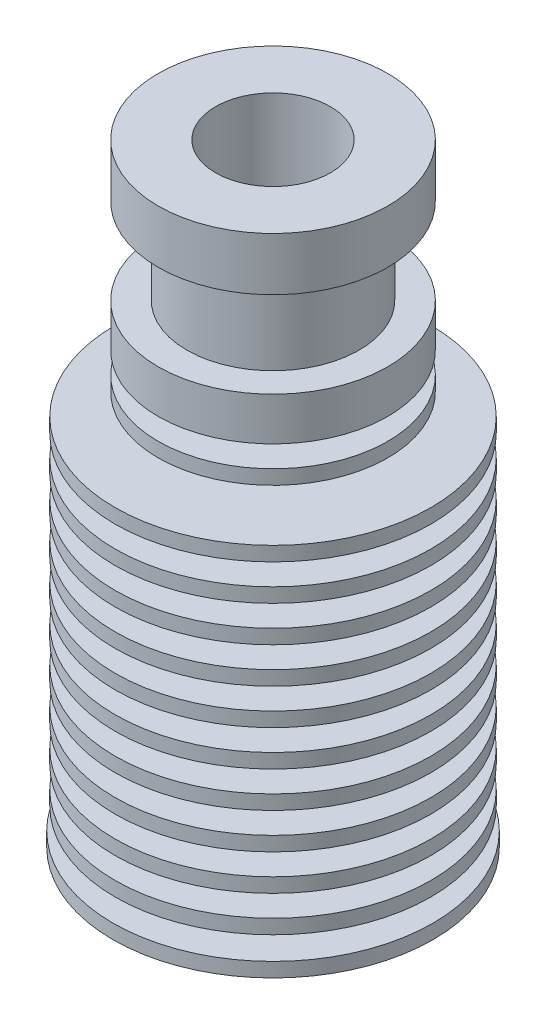
ISO-10303-21;
HEADER;
FILE_DESCRIPTION(('STEP AP214'),'2;1');
FILE_NAME('part.step','',(''),(''),'','','');
FILE_SCHEMA(('AUTOMOTIVE_DESIGN { 1 0 10303 214 1 1 1 1 }'));
ENDSEC;
DATA;
#1=APPLICATION_CONTEXT('core data for automotive mechanical design processes');
#2=APPLICATION_PROTOCOL_DEFINITION('international standard','automotive_design',2000,#1);
#3=PRODUCT_CONTEXT('',#1,'mechanical');
#4=PRODUCT('Part','Part','',(#3));
#5=PRODUCT_RELATED_PRODUCT_CATEGORY('part','',(#4));
#6=PRODUCT_DEFINITION_FORMATION('','',#4);
#7=PRODUCT_DEFINITION_CONTEXT('part definition',#1,'design');
#8=PRODUCT_DEFINITION('design','',#6,#7);
#9=PRODUCT_DEFINITION_SHAPE('','',#8);
#10=(LENGTH_UNIT() NAMED_UNIT(*) SI_UNIT(.MILLI.,.METRE.));
#11=(NAMED_UNIT(*) PLANE_ANGLE_UNIT() SI_UNIT($,.RADIAN.));
#12=(NAMED_UNIT(*) SI_UNIT($,.STERADIAN.) SOLID_ANGLE_UNIT());
#13=UNCERTAINTY_MEASURE_WITH_UNIT(LENGTH_MEASURE(1.E-05),#10,'distance_accuracy_value','');
#14=(GEOMETRIC_REPRESENTATION_CONTEXT(3) GLOBAL_UNCERTAINTY_ASSIGNED_CONTEXT((#13)) GLOBAL_UNIT_ASSIGNED_CONTEXT((#10,
#11,#12)) REPRESENTATION_CONTEXT('',''));
#15=CARTESIAN_POINT('',(0.,0.,0.));
#16=DIRECTION('',(0.,0.,1.));
#17=DIRECTION('',(1.,0.,0.));
#18=AXIS2_PLACEMENT_3D('',#15,#16,#17);
#19=CARTESIAN_POINT('',(0.,0.,0.));
#20=DIRECTION('',(0.,1.,0.));
#21=DIRECTION('',(0.,0.,1.));
#22=AXIS2_PLACEMENT_3D('',#19,#20,#21);
#23=PLANE('',#22);
#24=CARTESIAN_POINT('',(0.,0.,0.));
#25=DIRECTION('',(0.,-1.,0.));
#26=DIRECTION('',(0.,0.,-1.));
#27=AXIS2_PLACEMENT_3D('',#24,#25,#26);
#28=CIRCLE('',#27,3.);
#29=CARTESIAN_POINT('',(0.,0.,-3.));
#30=VERTEX_POINT('',#29);
#31=EDGE_CURVE('E285',#30,#30,#28,.T.);
#32=ORIENTED_EDGE('',*,*,#31,.F.);
#33=EDGE_LOOP('',(#32));
#34=FACE_BOUND('',#33,.T.);
#35=CARTESIAN_POINT('',(0.,0.,0.));
#36=DIRECTION('',(0.,1.,0.));
#37=DIRECTION('',(0.,0.,1.));
#38=AXIS2_PLACEMENT_3D('',#35,#36,#37);
#39=CIRCLE('',#38,11.15);
#40=CARTESIAN_POINT('',(0.,0.,11.15));
#41=VERTEX_POINT('',#40);
#42=EDGE_CURVE('E111',#41,#41,#39,.T.);
#43=ORIENTED_EDGE('',*,*,#42,.F.);
#44=EDGE_LOOP('',(#43));
#45=FACE_BOUND('',#44,.T.);
#46=ADVANCED_FACE('F45',(#34,#45),#23,.F.);
#47=CARTESIAN_POINT('',(0.,42.7,0.));
#48=DIRECTION('',(0.,-1.,0.));
#49=DIRECTION('',(0.,0.,-1.));
#50=AXIS2_PLACEMENT_3D('',#47,#48,#49);
#51=PLANE('',#50);
#52=CARTESIAN_POINT('',(0.,42.7,0.));
#53=DIRECTION('',(0.,1.,0.));
#54=DIRECTION('',(0.,0.,1.));
#55=AXIS2_PLACEMENT_3D('',#52,#53,#54);
#56=CIRCLE('',#55,7.99999999999999);
#57=CARTESIAN_POINT('',(0.,42.7,7.99999999999999));
#58=VERTEX_POINT('',#57);
#59=EDGE_CURVE('E107',#58,#58,#56,.T.);
#60=ORIENTED_EDGE('',*,*,#59,.T.);
#61=EDGE_LOOP('',(#60));
#62=FACE_BOUND('',#61,.T.);
#63=CARTESIAN_POINT('',(0.,42.7,0.));
#64=DIRECTION('',(0.,1.,0.));
#65=DIRECTION('',(0.,0.,1.));
#66=AXIS2_PLACEMENT_3D('',#63,#64,#65);
#67=CIRCLE('',#66,4.);
#68=CARTESIAN_POINT('',(0.,42.7,4.));
#69=VERTEX_POINT('',#68);
#70=EDGE_CURVE('E277',#69,#69,#67,.T.);
#71=ORIENTED_EDGE('',*,*,#70,.F.);
#72=EDGE_LOOP('',(#71));
#73=FACE_BOUND('',#72,.T.);
#74=ADVANCED_FACE('F294',(#62,#73),#51,.F.);
#75=CARTESIAN_POINT('',(0.,0.,0.));
#76=DIRECTION('',(0.,1.,0.));
#77=DIRECTION('',(0.,0.,1.));
#78=AXIS2_PLACEMENT_3D('',#75,#76,#77);
#79=CYLINDRICAL_SURFACE('',#78,11.);
#80=CARTESIAN_POINT('',(0.,22.5,0.));
#81=DIRECTION('',(0.,-1.,0.));
#82=DIRECTION('',(0.,0.,-1.));
#83=AXIS2_PLACEMENT_3D('',#80,#81,#82);
#84=CIRCLE('',#83,11.);
#85=CARTESIAN_POINT('',(0.,22.5,-11.));
#86=VERTEX_POINT('',#85);
#87=EDGE_CURVE('E237',#86,#86,#84,.T.);
#88=ORIENTED_EDGE('',*,*,#87,.F.);
#89=EDGE_LOOP('',(#88));
#90=FACE_BOUND('',#89,.T.);
#91=CARTESIAN_POINT('',(0.,23.5,0.));
#92=DIRECTION('',(0.,-1.,0.));
#93=DIRECTION('',(0.,0.,-1.));
#94=AXIS2_PLACEMENT_3D('',#91,#92,#93);
#95=CIRCLE('',#94,11.);
#96=CARTESIAN_POINT('',(0.,23.5,-11.));
#97=VERTEX_POINT('',#96);
#98=EDGE_CURVE('E265',#97,#97,#95,.T.);
#99=ORIENTED_EDGE('',*,*,#98,.T.);
#100=EDGE_LOOP('',(#99));
#101=FACE_BOUND('',#100,.T.);
#102=ADVANCED_FACE('F361',(#90,#101),#79,.T.);
#103=CARTESIAN_POINT('',(0.,20.,0.));
#104=DIRECTION('',(0.,-1.,0.));
#105=DIRECTION('',(0.,0.,-1.));
#106=AXIS2_PLACEMENT_3D('',#103,#104,#105);
#107=CIRCLE('',#106,11.);
#108=CARTESIAN_POINT('',(0.,20.,-11.));
#109=VERTEX_POINT('',#108);
#110=EDGE_CURVE('E221',#109,#109,#107,.T.);
#111=ORIENTED_EDGE('',*,*,#110,.F.);
#112=EDGE_LOOP('',(#111));
#113=FACE_BOUND('',#112,.T.);
#114=CARTESIAN_POINT('',(0.,21.,0.));
#115=DIRECTION('',(0.,-1.,0.));
#116=DIRECTION('',(0.,0.,-1.));
#117=AXIS2_PLACEMENT_3D('',#114,#115,#116);
#118=CIRCLE('',#117,11.);
#119=CARTESIAN_POINT('',(0.,21.,-11.));
#120=VERTEX_POINT('',#119);
#121=EDGE_CURVE('E249',#120,#120,#118,.T.);
#122=ORIENTED_EDGE('',*,*,#121,.T.);
#123=EDGE_LOOP('',(#122));
#124=FACE_BOUND('',#123,.T.);
#125=ADVANCED_FACE('F425',(#113,#124),#79,.T.);
#126=CARTESIAN_POINT('',(0.,17.5,0.));
#127=DIRECTION('',(0.,-1.,0.));
#128=DIRECTION('',(0.,0.,-1.));
#129=AXIS2_PLACEMENT_3D('',#126,#127,#128);
#130=CIRCLE('',#129,11.);
#131=CARTESIAN_POINT('',(0.,17.5,-11.));
#132=VERTEX_POINT('',#131);
#133=EDGE_CURVE('E205',#132,#132,#130,.T.);
#134=ORIENTED_EDGE('',*,*,#133,.F.);
#135=EDGE_LOOP('',(#134));
#136=FACE_BOUND('',#135,.T.);
#137=CARTESIAN_POINT('',(0.,18.5,0.));
#138=DIRECTION('',(0.,-1.,0.));
#139=DIRECTION('',(0.,0.,-1.));
#140=AXIS2_PLACEMENT_3D('',#137,#138,#139);
#141=CIRCLE('',#140,11.);
#142=CARTESIAN_POINT('',(0.,18.5,-11.));
#143=VERTEX_POINT('',#142);
#144=EDGE_CURVE('E233',#143,#143,#141,.T.);
#145=ORIENTED_EDGE('',*,*,#144,.T.);
#146=EDGE_LOOP('',(#145));
#147=FACE_BOUND('',#146,.T.);
#148=ADVANCED_FACE('F690',(#136,#147),#79,.T.);
#149=CARTESIAN_POINT('',(0.,15.,0.));
#150=DIRECTION('',(0.,-1.,0.));
#151=DIRECTION('',(0.,0.,-1.));
#152=AXIS2_PLACEMENT_3D('',#149,#150,#151);
#153=CIRCLE('',#152,11.);
#154=CARTESIAN_POINT('',(0.,15.,-11.));
#155=VERTEX_POINT('',#154);
#156=EDGE_CURVE('E189',#155,#155,#153,.T.);
#157=ORIENTED_EDGE('',*,*,#156,.F.);
#158=EDGE_LOOP('',(#157));
#159=FACE_BOUND('',#158,.T.);
#160=CARTESIAN_POINT('',(0.,16.,0.));
#161=DIRECTION('',(0.,-1.,0.));
#162=DIRECTION('',(0.,0.,-1.));
#163=AXIS2_PLACEMENT_3D('',#160,#161,#162);
#164=CIRCLE('',#163,11.);
#165=CARTESIAN_POINT('',(0.,16.,-11.));
#166=VERTEX_POINT('',#165);
#167=EDGE_CURVE('E217',#166,#166,#164,.T.);
#168=ORIENTED_EDGE('',*,*,#167,.T.);
#169=EDGE_LOOP('',(#168));
#170=FACE_BOUND('',#169,.T.);
#171=ADVANCED_FACE('F454',(#159,#170),#79,.T.);
#172=CARTESIAN_POINT('',(0.,12.5,0.));
#173=DIRECTION('',(0.,-1.,0.));
#174=DIRECTION('',(0.,0.,-1.));
#175=AXIS2_PLACEMENT_3D('',#172,#173,#174);
#176=CIRCLE('',#175,11.);
#177=CARTESIAN_POINT('',(0.,12.5,-11.));
#178=VERTEX_POINT('',#177);
#179=EDGE_CURVE('E173',#178,#178,#176,.T.);
#180=ORIENTED_EDGE('',*,*,#179,.F.);
#181=EDGE_LOOP('',(#180));
#182=FACE_BOUND('',#181,.T.);
#183=CARTESIAN_POINT('',(0.,13.5,0.));
#184=DIRECTION('',(0.,-1.,0.));
#185=DIRECTION('',(0.,0.,-1.));
#186=AXIS2_PLACEMENT_3D('',#183,#184,#185);
#187=CIRCLE('',#186,11.);
#188=CARTESIAN_POINT('',(0.,13.5,-11.));
#189=VERTEX_POINT('',#188);
#190=EDGE_CURVE('E201',#189,#189,#187,.T.);
#191=ORIENTED_EDGE('',*,*,#190,.T.);
#192=EDGE_LOOP('',(#191));
#193=FACE_BOUND('',#192,.T.);
#194=ADVANCED_FACE('F449',(#182,#193),#79,.T.);
#195=CARTESIAN_POINT('',(0.,10.,0.));
#196=DIRECTION('',(0.,-1.,0.));
#197=DIRECTION('',(0.,0.,-1.));
#198=AXIS2_PLACEMENT_3D('',#195,#196,#197);
#199=CIRCLE('',#198,11.);
#200=CARTESIAN_POINT('',(0.,10.,-11.));
#201=VERTEX_POINT('',#200);
#202=EDGE_CURVE('E157',#201,#201,#199,.T.);
#203=ORIENTED_EDGE('',*,*,#202,.F.);
#204=EDGE_LOOP('',(#203));
#205=FACE_BOUND('',#204,.T.);
#206=CARTESIAN_POINT('',(0.,11.,0.));
#207=DIRECTION('',(0.,-1.,0.));
#208=DIRECTION('',(0.,0.,-1.));
#209=AXIS2_PLACEMENT_3D('',#206,#207,#208);
#210=CIRCLE('',#209,11.);
#211=CARTESIAN_POINT('',(0.,11.,-11.));
#212=VERTEX_POINT('',#211);
#213=EDGE_CURVE('E185',#212,#212,#210,.T.);
#214=ORIENTED_EDGE('',*,*,#213,.T.);
#215=EDGE_LOOP('',(#214));
#216=FACE_BOUND('',#215,.T.);
#217=ADVANCED_FACE('F323',(#205,#216),#79,.T.);
#218=CARTESIAN_POINT('',(0.,10.,0.));
#219=DIRECTION('',(0.,-1.,0.));
#220=DIRECTION('',(0.,0.,-1.));
#221=AXIS2_PLACEMENT_3D('',#218,#219,#220);
#222=PLANE('',#221);
#223=ORIENTED_EDGE('',*,*,#202,.T.);
#224=EDGE_LOOP('',(#223));
#225=FACE_BOUND('',#224,.T.);
#226=CARTESIAN_POINT('',(0.,10.,0.));
#227=DIRECTION('',(0.,-1.,0.));
#228=DIRECTION('',(0.,0.,-1.));
#229=AXIS2_PLACEMENT_3D('',#226,#227,#228);
#230=CIRCLE('',#229,6.);
#231=CARTESIAN_POINT('',(0.,10.,-6.));
#232=VERTEX_POINT('',#231);
#233=EDGE_CURVE('E161',#232,#232,#230,.T.);
#234=ORIENTED_EDGE('',*,*,#233,.F.);
#235=EDGE_LOOP('',(#234));
#236=FACE_BOUND('',#235,.T.);
#237=ADVANCED_FACE('F313',(#225,#236),#222,.T.);
#238=CARTESIAN_POINT('',(0.,7.5,0.));
#239=DIRECTION('',(0.,-1.,0.));
#240=DIRECTION('',(0.,0.,-1.));
#241=AXIS2_PLACEMENT_3D('',#238,#239,#240);
#242=CYLINDRICAL_SURFACE('',#241,6.);
#243=ORIENTED_EDGE('',*,*,#233,.T.);
#244=EDGE_LOOP('',(#243));
#245=FACE_BOUND('',#244,.T.);
#246=CARTESIAN_POINT('',(0.,8.5,0.));
#247=DIRECTION('',(0.,-1.,0.));
#248=DIRECTION('',(0.,0.,-1.));
#249=AXIS2_PLACEMENT_3D('',#246,#247,#248);
#250=CIRCLE('',#249,6.);
#251=CARTESIAN_POINT('',(0.,8.5,-6.));
#252=VERTEX_POINT('',#251);
#253=EDGE_CURVE('E165',#252,#252,#250,.T.);
#254=ORIENTED_EDGE('',*,*,#253,.F.);
#255=EDGE_LOOP('',(#254));
#256=FACE_BOUND('',#255,.T.);
#257=ADVANCED_FACE('F307',(#245,#256),#242,.T.);
#258=CARTESIAN_POINT('',(0.,8.5,0.));
#259=DIRECTION('',(0.,1.,0.));
#260=DIRECTION('',(0.,0.,1.));
#261=AXIS2_PLACEMENT_3D('',#258,#259,#260);
#262=PLANE('',#261);
#263=ORIENTED_EDGE('',*,*,#253,.T.);
#264=EDGE_LOOP('',(#263));
#265=FACE_BOUND('',#264,.T.);
#266=CARTESIAN_POINT('',(0.,8.5,0.));
#267=DIRECTION('',(0.,-1.,0.));
#268=DIRECTION('',(0.,0.,-1.));
#269=AXIS2_PLACEMENT_3D('',#266,#267,#268);
#270=CIRCLE('',#269,11.);
#271=CARTESIAN_POINT('',(0.,8.5,-11.));
#272=VERTEX_POINT('',#271);
#273=EDGE_CURVE('E169',#272,#272,#270,.T.);
#274=ORIENTED_EDGE('',*,*,#273,.F.);
#275=EDGE_LOOP('',(#274));
#276=FACE_BOUND('',#275,.T.);
#277=ADVANCED_FACE('F300',(#265,#276),#262,.T.);
#278=CARTESIAN_POINT('',(0.,0.,0.));
#279=DIRECTION('',(0.,1.,0.));
#280=DIRECTION('',(0.,0.,1.));
#281=AXIS2_PLACEMENT_3D('',#278,#279,#280);
#282=CYLINDRICAL_SURFACE('',#281,11.15);
#283=CARTESIAN_POINT('',(0.,1.,0.));
#284=DIRECTION('',(0.,1.,0.));
#285=DIRECTION('',(0.,0.,1.));
#286=AXIS2_PLACEMENT_3D('',#283,#284,#285);
#287=CIRCLE('',#286,11.15);
#288=CARTESIAN_POINT('',(0.,1.,11.15));
#289=VERTEX_POINT('',#288);
#290=EDGE_CURVE('E11',#289,#289,#287,.T.);
#291=ORIENTED_EDGE('',*,*,#290,.F.);
#292=EDGE_LOOP('',(#291));
#293=FACE_BOUND('',#292,.T.);
#294=ORIENTED_EDGE('',*,*,#42,.T.);
#295=EDGE_LOOP('',(#294));
#296=FACE_BOUND('',#295,.T.);
#297=ADVANCED_FACE('F47',(#293,#296),#282,.T.);
#298=CARTESIAN_POINT('',(0.,1.,0.));
#299=DIRECTION('',(0.,-1.,0.));
#300=DIRECTION('',(0.,0.,-1.));
#301=AXIS2_PLACEMENT_3D('',#298,#299,#300);
#302=PLANE('',#301);
#303=ORIENTED_EDGE('',*,*,#290,.T.);
#304=EDGE_LOOP('',(#303));
#305=FACE_BOUND('',#304,.T.);
#306=CARTESIAN_POINT('',(0.,0.999999999999999,0.));
#307=DIRECTION('',(0.,-1.,0.));
#308=DIRECTION('',(0.,0.,-1.));
#309=AXIS2_PLACEMENT_3D('',#306,#307,#308);
#310=CIRCLE('',#309,6.);
#311=CARTESIAN_POINT('',(0.,0.999999999999999,-6.));
#312=VERTEX_POINT('',#311);
#313=EDGE_CURVE('E122',#312,#312,#310,.T.);
#314=ORIENTED_EDGE('',*,*,#313,.T.);
#315=EDGE_LOOP('',(#314));
#316=FACE_BOUND('',#315,.T.);
#317=ADVANCED_FACE('F299',(#305,#316),#302,.F.);
#318=CARTESIAN_POINT('',(0.,0.,0.));
#319=DIRECTION('',(0.,-1.,0.));
#320=DIRECTION('',(0.,0.,-1.));
#321=AXIS2_PLACEMENT_3D('',#318,#319,#320);
#322=CYLINDRICAL_SURFACE('',#321,6.);
#323=CARTESIAN_POINT('',(0.,2.5,0.));
#324=DIRECTION('',(0.,-1.,0.));
#325=DIRECTION('',(0.,0.,-1.));
#326=AXIS2_PLACEMENT_3D('',#323,#324,#325);
#327=CIRCLE('',#326,6.);
#328=CARTESIAN_POINT('',(0.,2.5,-6.));
#329=VERTEX_POINT('',#328);
#330=EDGE_CURVE('E119',#329,#329,#327,.T.);
#331=ORIENTED_EDGE('',*,*,#330,.T.);
#332=EDGE_LOOP('',(#331));
#333=FACE_BOUND('',#332,.T.);
#334=ORIENTED_EDGE('',*,*,#313,.F.);
#335=EDGE_LOOP('',(#334));
#336=FACE_BOUND('',#335,.T.);
#337=ADVANCED_FACE('F306',(#333,#336),#322,.T.);
#338=CARTESIAN_POINT('',(0.,2.5,0.));
#339=DIRECTION('',(0.,-1.,0.));
#340=DIRECTION('',(0.,0.,-1.));
#341=AXIS2_PLACEMENT_3D('',#338,#339,#340);
#342=PLANE('',#341);
#343=CARTESIAN_POINT('',(0.,2.5,0.));
#344=DIRECTION('',(0.,-1.,0.));
#345=DIRECTION('',(0.,0.,-1.));
#346=AXIS2_PLACEMENT_3D('',#343,#344,#345);
#347=CIRCLE('',#346,11.);
#348=CARTESIAN_POINT('',(0.,2.5,-11.));
#349=VERTEX_POINT('',#348);
#350=EDGE_CURVE('E115',#349,#349,#347,.T.);
#351=ORIENTED_EDGE('',*,*,#350,.T.);
#352=EDGE_LOOP('',(#351));
#353=FACE_BOUND('',#352,.T.);
#354=ORIENTED_EDGE('',*,*,#330,.F.);
#355=EDGE_LOOP('',(#354));
#356=FACE_BOUND('',#355,.T.);
#357=ADVANCED_FACE('F354',(#353,#356),#342,.T.);
#358=ORIENTED_EDGE('',*,*,#350,.F.);
#359=EDGE_LOOP('',(#358));
#360=FACE_BOUND('',#359,.T.);
#361=CARTESIAN_POINT('',(0.,3.5,0.));
#362=DIRECTION('',(0.,-1.,0.));
#363=DIRECTION('',(0.,0.,-1.));
#364=AXIS2_PLACEMENT_3D('',#361,#362,#363);
#365=CIRCLE('',#364,11.);
#366=CARTESIAN_POINT('',(0.,3.5,-11.));
#367=VERTEX_POINT('',#366);
#368=EDGE_CURVE('E137',#367,#367,#365,.T.);
#369=ORIENTED_EDGE('',*,*,#368,.T.);
#370=EDGE_LOOP('',(#369));
#371=FACE_BOUND('',#370,.T.);
#372=ADVANCED_FACE('F343',(#360,#371),#79,.T.);
#373=CARTESIAN_POINT('',(0.,3.5,0.));
#374=DIRECTION('',(0.,1.,0.));
#375=DIRECTION('',(0.,0.,1.));
#376=AXIS2_PLACEMENT_3D('',#373,#374,#375);
#377=PLANE('',#376);
#378=CARTESIAN_POINT('',(0.,3.5,0.));
#379=DIRECTION('',(0.,-1.,0.));
#380=DIRECTION('',(0.,0.,-1.));
#381=AXIS2_PLACEMENT_3D('',#378,#379,#380);
#382=CIRCLE('',#381,6.);
#383=CARTESIAN_POINT('',(0.,3.5,-6.));
#384=VERTEX_POINT('',#383);
#385=EDGE_CURVE('E133',#384,#384,#382,.T.);
#386=ORIENTED_EDGE('',*,*,#385,.T.);
#387=EDGE_LOOP('',(#386));
#388=FACE_BOUND('',#387,.T.);
#389=ORIENTED_EDGE('',*,*,#368,.F.);
#390=EDGE_LOOP('',(#389));
#391=FACE_BOUND('',#390,.T.);
#392=ADVANCED_FACE('F339',(#388,#391),#377,.T.);
#393=CARTESIAN_POINT('',(0.,2.5,0.));
#394=DIRECTION('',(0.,-1.,0.));
#395=DIRECTION('',(0.,0.,-1.));
#396=AXIS2_PLACEMENT_3D('',#393,#394,#395);
#397=CYLINDRICAL_SURFACE('',#396,6.);
#398=CARTESIAN_POINT('',(0.,5.,0.));
#399=DIRECTION('',(0.,-1.,0.));
#400=DIRECTION('',(0.,0.,-1.));
#401=AXIS2_PLACEMENT_3D('',#398,#399,#400);
#402=CIRCLE('',#401,6.);
#403=CARTESIAN_POINT('',(0.,5.,-6.));
#404=VERTEX_POINT('',#403);
#405=EDGE_CURVE('E129',#404,#404,#402,.T.);
#406=ORIENTED_EDGE('',*,*,#405,.T.);
#407=EDGE_LOOP('',(#406));
#408=FACE_BOUND('',#407,.T.);
#409=ORIENTED_EDGE('',*,*,#385,.F.);
#410=EDGE_LOOP('',(#409));
#411=FACE_BOUND('',#410,.T.);
#412=ADVANCED_FACE('F342',(#408,#411),#397,.T.);
#413=CARTESIAN_POINT('',(0.,5.,0.));
#414=DIRECTION('',(0.,-1.,0.));
#415=DIRECTION('',(0.,0.,-1.));
#416=AXIS2_PLACEMENT_3D('',#413,#414,#415);
#417=PLANE('',#416);
#418=CARTESIAN_POINT('',(0.,5.,0.));
#419=DIRECTION('',(0.,-1.,0.));
#420=DIRECTION('',(0.,0.,-1.));
#421=AXIS2_PLACEMENT_3D('',#418,#419,#420);
#422=CIRCLE('',#421,11.);
#423=CARTESIAN_POINT('',(0.,5.,-11.));
#424=VERTEX_POINT('',#423);
#425=EDGE_CURVE('E125',#424,#424,#422,.T.);
#426=ORIENTED_EDGE('',*,*,#425,.T.);
#427=EDGE_LOOP('',(#426));
#428=FACE_BOUND('',#427,.T.);
#429=ORIENTED_EDGE('',*,*,#405,.F.);
#430=EDGE_LOOP('',(#429));
#431=FACE_BOUND('',#430,.T.);
#432=ADVANCED_FACE('F347',(#428,#431),#417,.T.);
#433=ORIENTED_EDGE('',*,*,#425,.F.);
#434=EDGE_LOOP('',(#433));
#435=FACE_BOUND('',#434,.T.);
#436=CARTESIAN_POINT('',(0.,6.,0.));
#437=DIRECTION('',(0.,-1.,0.));
#438=DIRECTION('',(0.,0.,-1.));
#439=AXIS2_PLACEMENT_3D('',#436,#437,#438);
#440=CIRCLE('',#439,11.);
#441=CARTESIAN_POINT('',(0.,6.,-11.));
#442=VERTEX_POINT('',#441);
#443=EDGE_CURVE('E153',#442,#442,#440,.T.);
#444=ORIENTED_EDGE('',*,*,#443,.T.);
#445=EDGE_LOOP('',(#444));
#446=FACE_BOUND('',#445,.T.);
#447=ADVANCED_FACE('F329',(#435,#446),#79,.T.);
#448=CARTESIAN_POINT('',(0.,6.,0.));
#449=DIRECTION('',(0.,1.,0.));
#450=DIRECTION('',(0.,0.,1.));
#451=AXIS2_PLACEMENT_3D('',#448,#449,#450);
#452=PLANE('',#451);
#453=CARTESIAN_POINT('',(0.,6.,0.));
#454=DIRECTION('',(0.,-1.,0.));
#455=DIRECTION('',(0.,0.,-1.));
#456=AXIS2_PLACEMENT_3D('',#453,#454,#455);
#457=CIRCLE('',#456,6.);
#458=CARTESIAN_POINT('',(0.,6.,-6.));
#459=VERTEX_POINT('',#458);
#460=EDGE_CURVE('E149',#459,#459,#457,.T.);
#461=ORIENTED_EDGE('',*,*,#460,.T.);
#462=EDGE_LOOP('',(#461));
#463=FACE_BOUND('',#462,.T.);
#464=ORIENTED_EDGE('',*,*,#443,.F.);
#465=EDGE_LOOP('',(#464));
#466=FACE_BOUND('',#465,.T.);
#467=ADVANCED_FACE('F325',(#463,#466),#452,.T.);
#468=CARTESIAN_POINT('',(0.,5.,0.));
#469=DIRECTION('',(0.,-1.,0.));
#470=DIRECTION('',(0.,0.,-1.));
#471=AXIS2_PLACEMENT_3D('',#468,#469,#470);
#472=CYLINDRICAL_SURFACE('',#471,6.);
#473=CARTESIAN_POINT('',(0.,7.5,0.));
#474=DIRECTION('',(0.,-1.,0.));
#475=DIRECTION('',(0.,0.,-1.));
#476=AXIS2_PLACEMENT_3D('',#473,#474,#475);
#477=CIRCLE('',#476,6.);
#478=CARTESIAN_POINT('',(0.,7.5,-6.));
#479=VERTEX_POINT('',#478);
#480=EDGE_CURVE('E145',#479,#479,#477,.T.);
#481=ORIENTED_EDGE('',*,*,#480,.T.);
#482=EDGE_LOOP('',(#481));
#483=FACE_BOUND('',#482,.T.);
#484=ORIENTED_EDGE('',*,*,#460,.F.);
#485=EDGE_LOOP('',(#484));
#486=FACE_BOUND('',#485,.T.);
#487=ADVANCED_FACE('F328',(#483,#486),#472,.T.);
#488=CARTESIAN_POINT('',(0.,7.5,0.));
#489=DIRECTION('',(0.,-1.,0.));
#490=DIRECTION('',(0.,0.,-1.));
#491=AXIS2_PLACEMENT_3D('',#488,#489,#490);
#492=PLANE('',#491);
#493=CARTESIAN_POINT('',(0.,7.5,0.));
#494=DIRECTION('',(0.,-1.,0.));
#495=DIRECTION('',(0.,0.,-1.));
#496=AXIS2_PLACEMENT_3D('',#493,#494,#495);
#497=CIRCLE('',#496,11.);
#498=CARTESIAN_POINT('',(0.,7.5,-11.));
#499=VERTEX_POINT('',#498);
#500=EDGE_CURVE('E141',#499,#499,#497,.T.);
#501=ORIENTED_EDGE('',*,*,#500,.T.);
#502=EDGE_LOOP('',(#501));
#503=FACE_BOUND('',#502,.T.);
#504=ORIENTED_EDGE('',*,*,#480,.F.);
#505=EDGE_LOOP('',(#504));
#506=FACE_BOUND('',#505,.T.);
#507=ADVANCED_FACE('F333',(#503,#506),#492,.T.);
#508=ORIENTED_EDGE('',*,*,#500,.F.);
#509=EDGE_LOOP('',(#508));
#510=FACE_BOUND('',#509,.T.);
#511=ORIENTED_EDGE('',*,*,#273,.T.);
#512=EDGE_LOOP('',(#511));
#513=FACE_BOUND('',#512,.T.);
#514=ADVANCED_FACE('F337',(#510,#513),#79,.T.);
#515=CARTESIAN_POINT('',(0.,12.5,0.));
#516=DIRECTION('',(0.,-1.,0.));
#517=DIRECTION('',(0.,0.,-1.));
#518=AXIS2_PLACEMENT_3D('',#515,#516,#517);
#519=PLANE('',#518);
#520=ORIENTED_EDGE('',*,*,#179,.T.);
#521=EDGE_LOOP('',(#520));
#522=FACE_BOUND('',#521,.T.);
#523=CARTESIAN_POINT('',(0.,12.5,0.));
#524=DIRECTION('',(0.,-1.,0.));
#525=DIRECTION('',(0.,0.,-1.));
#526=AXIS2_PLACEMENT_3D('',#523,#524,#525);
#527=CIRCLE('',#526,6.);
#528=CARTESIAN_POINT('',(0.,12.5,-6.));
#529=VERTEX_POINT('',#528);
#530=EDGE_CURVE('E177',#529,#529,#527,.T.);
#531=ORIENTED_EDGE('',*,*,#530,.F.);
#532=EDGE_LOOP('',(#531));
#533=FACE_BOUND('',#532,.T.);
#534=ADVANCED_FACE('F318',(#522,#533),#519,.T.);
#535=CARTESIAN_POINT('',(0.,10.,0.));
#536=DIRECTION('',(0.,-1.,0.));
#537=DIRECTION('',(0.,0.,-1.));
#538=AXIS2_PLACEMENT_3D('',#535,#536,#537);
#539=CYLINDRICAL_SURFACE('',#538,6.);
#540=ORIENTED_EDGE('',*,*,#530,.T.);
#541=EDGE_LOOP('',(#540));
#542=FACE_BOUND('',#541,.T.);
#543=CARTESIAN_POINT('',(0.,11.,0.));
#544=DIRECTION('',(0.,-1.,0.));
#545=DIRECTION('',(0.,0.,-1.));
#546=AXIS2_PLACEMENT_3D('',#543,#544,#545);
#547=CIRCLE('',#546,6.);
#548=CARTESIAN_POINT('',(0.,11.,-6.));
#549=VERTEX_POINT('',#548);
#550=EDGE_CURVE('E181',#549,#549,#547,.T.);
#551=ORIENTED_EDGE('',*,*,#550,.F.);
#552=EDGE_LOOP('',(#551));
#553=FACE_BOUND('',#552,.T.);
#554=ADVANCED_FACE('F444',(#542,#553),#539,.T.);
#555=CARTESIAN_POINT('',(0.,11.,0.));
#556=DIRECTION('',(0.,1.,0.));
#557=DIRECTION('',(0.,0.,1.));
#558=AXIS2_PLACEMENT_3D('',#555,#556,#557);
#559=PLANE('',#558);
#560=ORIENTED_EDGE('',*,*,#550,.T.);
#561=EDGE_LOOP('',(#560));
#562=FACE_BOUND('',#561,.T.);
#563=ORIENTED_EDGE('',*,*,#213,.F.);
#564=EDGE_LOOP('',(#563));
#565=FACE_BOUND('',#564,.T.);
#566=ADVANCED_FACE('F460',(#562,#565),#559,.T.);
#567=CARTESIAN_POINT('',(0.,15.,0.));
#568=DIRECTION('',(0.,-1.,0.));
#569=DIRECTION('',(0.,0.,-1.));
#570=AXIS2_PLACEMENT_3D('',#567,#568,#569);
#571=PLANE('',#570);
#572=ORIENTED_EDGE('',*,*,#156,.T.);
#573=EDGE_LOOP('',(#572));
#574=FACE_BOUND('',#573,.T.);
#575=CARTESIAN_POINT('',(0.,15.,0.));
#576=DIRECTION('',(0.,-1.,0.));
#577=DIRECTION('',(0.,0.,-1.));
#578=AXIS2_PLACEMENT_3D('',#575,#576,#577);
#579=CIRCLE('',#578,6.);
#580=CARTESIAN_POINT('',(0.,15.,-6.));
#581=VERTEX_POINT('',#580);
#582=EDGE_CURVE('E193',#581,#581,#579,.T.);
#583=ORIENTED_EDGE('',*,*,#582,.F.);
#584=EDGE_LOOP('',(#583));
#585=FACE_BOUND('',#584,.T.);
#586=ADVANCED_FACE('F462',(#574,#585),#571,.T.);
#587=CARTESIAN_POINT('',(0.,12.5,0.));
#588=DIRECTION('',(0.,-1.,0.));
#589=DIRECTION('',(0.,0.,-1.));
#590=AXIS2_PLACEMENT_3D('',#587,#588,#589);
#591=CYLINDRICAL_SURFACE('',#590,6.);
#592=ORIENTED_EDGE('',*,*,#582,.T.);
#593=EDGE_LOOP('',(#592));
#594=FACE_BOUND('',#593,.T.);
#595=CARTESIAN_POINT('',(0.,13.5,0.));
#596=DIRECTION('',(0.,-1.,0.));
#597=DIRECTION('',(0.,0.,-1.));
#598=AXIS2_PLACEMENT_3D('',#595,#596,#597);
#599=CIRCLE('',#598,6.);
#600=CARTESIAN_POINT('',(0.,13.5,-6.));
#601=VERTEX_POINT('',#600);
#602=EDGE_CURVE('E197',#601,#601,#599,.T.);
#603=ORIENTED_EDGE('',*,*,#602,.F.);
#604=EDGE_LOOP('',(#603));
#605=FACE_BOUND('',#604,.T.);
#606=ADVANCED_FACE('F469',(#594,#605),#591,.T.);
#607=CARTESIAN_POINT('',(0.,13.5,0.));
#608=DIRECTION('',(0.,1.,0.));
#609=DIRECTION('',(0.,0.,1.));
#610=AXIS2_PLACEMENT_3D('',#607,#608,#609);
#611=PLANE('',#610);
#612=ORIENTED_EDGE('',*,*,#602,.T.);
#613=EDGE_LOOP('',(#612));
#614=FACE_BOUND('',#613,.T.);
#615=ORIENTED_EDGE('',*,*,#190,.F.);
#616=EDGE_LOOP('',(#615));
#617=FACE_BOUND('',#616,.T.);
#618=ADVANCED_FACE('F476',(#614,#617),#611,.T.);
#619=CARTESIAN_POINT('',(0.,17.5,0.));
#620=DIRECTION('',(0.,-1.,0.));
#621=DIRECTION('',(0.,0.,-1.));
#622=AXIS2_PLACEMENT_3D('',#619,#620,#621);
#623=PLANE('',#622);
#624=ORIENTED_EDGE('',*,*,#133,.T.);
#625=EDGE_LOOP('',(#624));
#626=FACE_BOUND('',#625,.T.);
#627=CARTESIAN_POINT('',(0.,17.5,0.));
#628=DIRECTION('',(0.,-1.,0.));
#629=DIRECTION('',(0.,0.,-1.));
#630=AXIS2_PLACEMENT_3D('',#627,#628,#629);
#631=CIRCLE('',#630,6.);
#632=CARTESIAN_POINT('',(0.,17.5,-6.));
#633=VERTEX_POINT('',#632);
#634=EDGE_CURVE('E209',#633,#633,#631,.T.);
#635=ORIENTED_EDGE('',*,*,#634,.F.);
#636=EDGE_LOOP('',(#635));
#637=FACE_BOUND('',#636,.T.);
#638=ADVANCED_FACE('F480',(#626,#637),#623,.T.);
#639=CARTESIAN_POINT('',(0.,15.,0.));
#640=DIRECTION('',(0.,-1.,0.));
#641=DIRECTION('',(0.,0.,-1.));
#642=AXIS2_PLACEMENT_3D('',#639,#640,#641);
#643=CYLINDRICAL_SURFACE('',#642,6.);
#644=ORIENTED_EDGE('',*,*,#634,.T.);
#645=EDGE_LOOP('',(#644));
#646=FACE_BOUND('',#645,.T.);
#647=CARTESIAN_POINT('',(0.,16.,0.));
#648=DIRECTION('',(0.,-1.,0.));
#649=DIRECTION('',(0.,0.,-1.));
#650=AXIS2_PLACEMENT_3D('',#647,#648,#649);
#651=CIRCLE('',#650,6.);
#652=CARTESIAN_POINT('',(0.,16.,-6.));
#653=VERTEX_POINT('',#652);
#654=EDGE_CURVE('E213',#653,#653,#651,.T.);
#655=ORIENTED_EDGE('',*,*,#654,.F.);
#656=EDGE_LOOP('',(#655));
#657=FACE_BOUND('',#656,.T.);
#658=ADVANCED_FACE('F484',(#646,#657),#643,.T.);
#659=CARTESIAN_POINT('',(0.,16.,0.));
#660=DIRECTION('',(0.,1.,0.));
#661=DIRECTION('',(0.,0.,1.));
#662=AXIS2_PLACEMENT_3D('',#659,#660,#661);
#663=PLANE('',#662);
#664=ORIENTED_EDGE('',*,*,#654,.T.);
#665=EDGE_LOOP('',(#664));
#666=FACE_BOUND('',#665,.T.);
#667=ORIENTED_EDGE('',*,*,#167,.F.);
#668=EDGE_LOOP('',(#667));
#669=FACE_BOUND('',#668,.T.);
#670=ADVANCED_FACE('F488',(#666,#669),#663,.T.);
#671=CARTESIAN_POINT('',(0.,20.,0.));
#672=DIRECTION('',(0.,-1.,0.));
#673=DIRECTION('',(0.,0.,-1.));
#674=AXIS2_PLACEMENT_3D('',#671,#672,#673);
#675=PLANE('',#674);
#676=ORIENTED_EDGE('',*,*,#110,.T.);
#677=EDGE_LOOP('',(#676));
#678=FACE_BOUND('',#677,.T.);
#679=CARTESIAN_POINT('',(0.,20.,0.));
#680=DIRECTION('',(0.,-1.,0.));
#681=DIRECTION('',(0.,0.,-1.));
#682=AXIS2_PLACEMENT_3D('',#679,#680,#681);
#683=CIRCLE('',#682,6.);
#684=CARTESIAN_POINT('',(0.,20.,-6.));
#685=VERTEX_POINT('',#684);
#686=EDGE_CURVE('E225',#685,#685,#683,.T.);
#687=ORIENTED_EDGE('',*,*,#686,.F.);
#688=EDGE_LOOP('',(#687));
#689=FACE_BOUND('',#688,.T.);
#690=ADVANCED_FACE('F492',(#678,#689),#675,.T.);
#691=CARTESIAN_POINT('',(0.,17.5,0.));
#692=DIRECTION('',(0.,-1.,0.));
#693=DIRECTION('',(0.,0.,-1.));
#694=AXIS2_PLACEMENT_3D('',#691,#692,#693);
#695=CYLINDRICAL_SURFACE('',#694,6.);
#696=ORIENTED_EDGE('',*,*,#686,.T.);
#697=EDGE_LOOP('',(#696));
#698=FACE_BOUND('',#697,.T.);
#699=CARTESIAN_POINT('',(0.,18.5,0.));
#700=DIRECTION('',(0.,-1.,0.));
#701=DIRECTION('',(0.,0.,-1.));
#702=AXIS2_PLACEMENT_3D('',#699,#700,#701);
#703=CIRCLE('',#702,6.);
#704=CARTESIAN_POINT('',(0.,18.5,-6.));
#705=VERTEX_POINT('',#704);
#706=EDGE_CURVE('E229',#705,#705,#703,.T.);
#707=ORIENTED_EDGE('',*,*,#706,.F.);
#708=EDGE_LOOP('',(#707));
#709=FACE_BOUND('',#708,.T.);
#710=ADVANCED_FACE('F496',(#698,#709),#695,.T.);
#711=CARTESIAN_POINT('',(0.,18.5,0.));
#712=DIRECTION('',(0.,1.,0.));
#713=DIRECTION('',(0.,0.,1.));
#714=AXIS2_PLACEMENT_3D('',#711,#712,#713);
#715=PLANE('',#714);
#716=ORIENTED_EDGE('',*,*,#706,.T.);
#717=EDGE_LOOP('',(#716));
#718=FACE_BOUND('',#717,.T.);
#719=ORIENTED_EDGE('',*,*,#144,.F.);
#720=EDGE_LOOP('',(#719));
#721=FACE_BOUND('',#720,.T.);
#722=ADVANCED_FACE('F500',(#718,#721),#715,.T.);
#723=CARTESIAN_POINT('',(0.,22.5,0.));
#724=DIRECTION('',(0.,-1.,0.));
#725=DIRECTION('',(0.,0.,-1.));
#726=AXIS2_PLACEMENT_3D('',#723,#724,#725);
#727=PLANE('',#726);
#728=ORIENTED_EDGE('',*,*,#87,.T.);
#729=EDGE_LOOP('',(#728));
#730=FACE_BOUND('',#729,.T.);
#731=CARTESIAN_POINT('',(0.,22.5,0.));
#732=DIRECTION('',(0.,-1.,0.));
#733=DIRECTION('',(0.,0.,-1.));
#734=AXIS2_PLACEMENT_3D('',#731,#732,#733);
#735=CIRCLE('',#734,6.);
#736=CARTESIAN_POINT('',(0.,22.5,-6.));
#737=VERTEX_POINT('',#736);
#738=EDGE_CURVE('E241',#737,#737,#735,.T.);
#739=ORIENTED_EDGE('',*,*,#738,.F.);
#740=EDGE_LOOP('',(#739));
#741=FACE_BOUND('',#740,.T.);
#742=ADVANCED_FACE('F504',(#730,#741),#727,.T.);
#743=CARTESIAN_POINT('',(0.,20.,0.));
#744=DIRECTION('',(0.,-1.,0.));
#745=DIRECTION('',(0.,0.,-1.));
#746=AXIS2_PLACEMENT_3D('',#743,#744,#745);
#747=CYLINDRICAL_SURFACE('',#746,6.);
#748=ORIENTED_EDGE('',*,*,#738,.T.);
#749=EDGE_LOOP('',(#748));
#750=FACE_BOUND('',#749,.T.);
#751=CARTESIAN_POINT('',(0.,21.,0.));
#752=DIRECTION('',(0.,-1.,0.));
#753=DIRECTION('',(0.,0.,-1.));
#754=AXIS2_PLACEMENT_3D('',#751,#752,#753);
#755=CIRCLE('',#754,6.);
#756=CARTESIAN_POINT('',(0.,21.,-6.));
#757=VERTEX_POINT('',#756);
#758=EDGE_CURVE('E245',#757,#757,#755,.T.);
#759=ORIENTED_EDGE('',*,*,#758,.F.);
#760=EDGE_LOOP('',(#759));
#761=FACE_BOUND('',#760,.T.);
#762=ADVANCED_FACE('F508',(#750,#761),#747,.T.);
#763=CARTESIAN_POINT('',(0.,21.,0.));
#764=DIRECTION('',(0.,1.,0.));
#765=DIRECTION('',(0.,0.,1.));
#766=AXIS2_PLACEMENT_3D('',#763,#764,#765);
#767=PLANE('',#766);
#768=ORIENTED_EDGE('',*,*,#758,.T.);
#769=EDGE_LOOP('',(#768));
#770=FACE_BOUND('',#769,.T.);
#771=ORIENTED_EDGE('',*,*,#121,.F.);
#772=EDGE_LOOP('',(#771));
#773=FACE_BOUND('',#772,.T.);
#774=ADVANCED_FACE('F512',(#770,#773),#767,.T.);
#775=CARTESIAN_POINT('',(0.,25.,0.));
#776=DIRECTION('',(0.,-1.,0.));
#777=DIRECTION('',(0.,0.,-1.));
#778=AXIS2_PLACEMENT_3D('',#775,#776,#777);
#779=PLANE('',#778);
#780=CARTESIAN_POINT('',(0.,25.,0.));
#781=DIRECTION('',(0.,-1.,0.));
#782=DIRECTION('',(0.,0.,-1.));
#783=AXIS2_PLACEMENT_3D('',#780,#781,#782);
#784=CIRCLE('',#783,11.);
#785=CARTESIAN_POINT('',(0.,25.,-11.));
#786=VERTEX_POINT('',#785);
#787=EDGE_CURVE('E253',#786,#786,#784,.T.);
#788=ORIENTED_EDGE('',*,*,#787,.T.);
#789=EDGE_LOOP('',(#788));
#790=FACE_BOUND('',#789,.T.);
#791=CARTESIAN_POINT('',(0.,25.,0.));
#792=DIRECTION('',(0.,-1.,0.));
#793=DIRECTION('',(0.,0.,-1.));
#794=AXIS2_PLACEMENT_3D('',#791,#792,#793);
#795=CIRCLE('',#794,6.);
#796=CARTESIAN_POINT('',(0.,25.,-6.));
#797=VERTEX_POINT('',#796);
#798=EDGE_CURVE('E257',#797,#797,#795,.T.);
#799=ORIENTED_EDGE('',*,*,#798,.F.);
#800=EDGE_LOOP('',(#799));
#801=FACE_BOUND('',#800,.T.);
#802=ADVANCED_FACE('F516',(#790,#801),#779,.T.);
#803=CARTESIAN_POINT('',(0.,22.5,0.));
#804=DIRECTION('',(0.,-1.,0.));
#805=DIRECTION('',(0.,0.,-1.));
#806=AXIS2_PLACEMENT_3D('',#803,#804,#805);
#807=CYLINDRICAL_SURFACE('',#806,6.);
#808=ORIENTED_EDGE('',*,*,#798,.T.);
#809=EDGE_LOOP('',(#808));
#810=FACE_BOUND('',#809,.T.);
#811=CARTESIAN_POINT('',(0.,23.5,0.));
#812=DIRECTION('',(0.,-1.,0.));
#813=DIRECTION('',(0.,0.,-1.));
#814=AXIS2_PLACEMENT_3D('',#811,#812,#813);
#815=CIRCLE('',#814,6.);
#816=CARTESIAN_POINT('',(0.,23.5,-6.));
#817=VERTEX_POINT('',#816);
#818=EDGE_CURVE('E261',#817,#817,#815,.T.);
#819=ORIENTED_EDGE('',*,*,#818,.F.);
#820=EDGE_LOOP('',(#819));
#821=FACE_BOUND('',#820,.T.);
#822=ADVANCED_FACE('F520',(#810,#821),#807,.T.);
#823=CARTESIAN_POINT('',(0.,23.5,0.));
#824=DIRECTION('',(0.,1.,0.));
#825=DIRECTION('',(0.,0.,1.));
#826=AXIS2_PLACEMENT_3D('',#823,#824,#825);
#827=PLANE('',#826);
#828=ORIENTED_EDGE('',*,*,#818,.T.);
#829=EDGE_LOOP('',(#828));
#830=FACE_BOUND('',#829,.T.);
#831=ORIENTED_EDGE('',*,*,#98,.F.);
#832=EDGE_LOOP('',(#831));
#833=FACE_BOUND('',#832,.T.);
#834=ADVANCED_FACE('F367',(#830,#833),#827,.T.);
#835=CARTESIAN_POINT('',(0.,0.,0.));
#836=DIRECTION('',(0.,1.,0.));
#837=DIRECTION('',(0.,0.,1.));
#838=AXIS2_PLACEMENT_3D('',#835,#836,#837);
#839=CYLINDRICAL_SURFACE('',#838,7.99999999999999);
#840=ORIENTED_EDGE('',*,*,#59,.F.);
#841=EDGE_LOOP('',(#840));
#842=FACE_BOUND('',#841,.T.);
#843=CARTESIAN_POINT('',(0.,39.,0.));
#844=DIRECTION('',(0.,1.,0.));
#845=DIRECTION('',(0.,0.,1.));
#846=AXIS2_PLACEMENT_3D('',#843,#844,#845);
#847=CIRCLE('',#846,7.99999999999999);
#848=CARTESIAN_POINT('',(0.,39.,7.99999999999999));
#849=VERTEX_POINT('',#848);
#850=EDGE_CURVE('E103',#849,#849,#847,.T.);
#851=ORIENTED_EDGE('',*,*,#850,.T.);
#852=EDGE_LOOP('',(#851));
#853=FACE_BOUND('',#852,.T.);
#854=ADVANCED_FACE('F363',(#842,#853),#839,.T.);
#855=CARTESIAN_POINT('',(0.,39.,0.));
#856=DIRECTION('',(0.,1.,0.));
#857=DIRECTION('',(0.,0.,1.));
#858=AXIS2_PLACEMENT_3D('',#855,#856,#857);
#859=PLANE('',#858);
#860=ORIENTED_EDGE('',*,*,#850,.F.);
#861=EDGE_LOOP('',(#860));
#862=FACE_BOUND('',#861,.T.);
#863=CARTESIAN_POINT('',(0.,39.,0.));
#864=DIRECTION('',(0.,1.,0.));
#865=DIRECTION('',(0.,0.,1.));
#866=AXIS2_PLACEMENT_3D('',#863,#864,#865);
#867=CIRCLE('',#866,5.99999999999999);
#868=CARTESIAN_POINT('',(0.,39.,5.99999999999999));
#869=VERTEX_POINT('',#868);
#870=EDGE_CURVE('E99',#869,#869,#867,.T.);
#871=ORIENTED_EDGE('',*,*,#870,.T.);
#872=EDGE_LOOP('',(#871));
#873=FACE_BOUND('',#872,.T.);
#874=ADVANCED_FACE('F366',(#862,#873),#859,.F.);
#875=CARTESIAN_POINT('',(0.,0.,0.));
#876=DIRECTION('',(0.,1.,0.));
#877=DIRECTION('',(0.,0.,1.));
#878=AXIS2_PLACEMENT_3D('',#875,#876,#877);
#879=CYLINDRICAL_SURFACE('',#878,5.99999999999999);
#880=ORIENTED_EDGE('',*,*,#870,.F.);
#881=EDGE_LOOP('',(#880));
#882=FACE_BOUND('',#881,.T.);
#883=CARTESIAN_POINT('',(0.,33.,0.));
#884=DIRECTION('',(0.,1.,0.));
#885=DIRECTION('',(0.,0.,1.));
#886=AXIS2_PLACEMENT_3D('',#883,#884,#885);
#887=CIRCLE('',#886,5.99999999999999);
#888=CARTESIAN_POINT('',(0.,33.,5.99999999999999));
#889=VERTEX_POINT('',#888);
#890=EDGE_CURVE('E95',#889,#889,#887,.T.);
#891=ORIENTED_EDGE('',*,*,#890,.T.);
#892=EDGE_LOOP('',(#891));
#893=FACE_BOUND('',#892,.T.);
#894=ADVANCED_FACE('F371',(#882,#893),#879,.T.);
#895=CARTESIAN_POINT('',(0.,33.,0.));
#896=DIRECTION('',(0.,-1.,0.));
#897=DIRECTION('',(0.,0.,-1.));
#898=AXIS2_PLACEMENT_3D('',#895,#896,#897);
#899=PLANE('',#898);
#900=ORIENTED_EDGE('',*,*,#890,.F.);
#901=EDGE_LOOP('',(#900));
#902=FACE_BOUND('',#901,.T.);
#903=CARTESIAN_POINT('',(0.,33.,0.));
#904=DIRECTION('',(0.,1.,0.));
#905=DIRECTION('',(0.,0.,1.));
#906=AXIS2_PLACEMENT_3D('',#903,#904,#905);
#907=CIRCLE('',#906,7.99999999999999);
#908=CARTESIAN_POINT('',(0.,33.,7.99999999999999));
#909=VERTEX_POINT('',#908);
#910=EDGE_CURVE('E91',#909,#909,#907,.T.);
#911=ORIENTED_EDGE('',*,*,#910,.T.);
#912=EDGE_LOOP('',(#911));
#913=FACE_BOUND('',#912,.T.);
#914=ADVANCED_FACE('F375',(#902,#913),#899,.F.);
#915=CARTESIAN_POINT('',(0.,0.,0.));
#916=DIRECTION('',(0.,1.,0.));
#917=DIRECTION('',(0.,0.,1.));
#918=AXIS2_PLACEMENT_3D('',#915,#916,#917);
#919=CYLINDRICAL_SURFACE('',#918,7.99999999999999);
#920=ORIENTED_EDGE('',*,*,#910,.F.);
#921=EDGE_LOOP('',(#920));
#922=FACE_BOUND('',#921,.T.);
#923=CARTESIAN_POINT('',(0.,30.,0.));
#924=DIRECTION('',(0.,1.,0.));
#925=DIRECTION('',(0.,0.,1.));
#926=AXIS2_PLACEMENT_3D('',#923,#924,#925);
#927=CIRCLE('',#926,7.99999999999999);
#928=CARTESIAN_POINT('',(0.,30.,7.99999999999999));
#929=VERTEX_POINT('',#928);
#930=EDGE_CURVE('E87',#929,#929,#927,.T.);
#931=ORIENTED_EDGE('',*,*,#930,.T.);
#932=EDGE_LOOP('',(#931));
#933=FACE_BOUND('',#932,.T.);
#934=ADVANCED_FACE('F379',(#922,#933),#919,.T.);
#935=CARTESIAN_POINT('',(0.,30.,0.));
#936=DIRECTION('',(0.,-1.,0.));
#937=DIRECTION('',(0.,0.,-1.));
#938=AXIS2_PLACEMENT_3D('',#935,#936,#937);
#939=PLANE('',#938);
#940=CARTESIAN_POINT('',(0.,30.,0.));
#941=DIRECTION('',(0.,1.,0.));
#942=DIRECTION('',(0.,0.,1.));
#943=AXIS2_PLACEMENT_3D('',#940,#941,#942);
#944=CIRCLE('',#943,3.5);
#945=CARTESIAN_POINT('',(0.,30.,3.5));
#946=VERTEX_POINT('',#945);
#947=EDGE_CURVE('E83',#946,#946,#944,.T.);
#948=ORIENTED_EDGE('',*,*,#947,.T.);
#949=EDGE_LOOP('',(#948));
#950=FACE_BOUND('',#949,.T.);
#951=ORIENTED_EDGE('',*,*,#930,.F.);
#952=EDGE_LOOP('',(#951));
#953=FACE_BOUND('',#952,.T.);
#954=ADVANCED_FACE('F383',(#950,#953),#939,.T.);
#955=CARTESIAN_POINT('',(0.,0.,0.));
#956=DIRECTION('',(0.,1.,0.));
#957=DIRECTION('',(0.,0.,1.));
#958=AXIS2_PLACEMENT_3D('',#955,#956,#957);
#959=CYLINDRICAL_SURFACE('',#958,3.5);
#960=ORIENTED_EDGE('',*,*,#947,.F.);
#961=EDGE_LOOP('',(#960));
#962=FACE_BOUND('',#961,.T.);
#963=CARTESIAN_POINT('',(0.,28.5,0.));
#964=DIRECTION('',(0.,1.,0.));
#965=DIRECTION('',(0.,0.,1.));
#966=AXIS2_PLACEMENT_3D('',#963,#964,#965);
#967=CIRCLE('',#966,3.5);
#968=CARTESIAN_POINT('',(0.,28.5,3.5));
#969=VERTEX_POINT('',#968);
#970=EDGE_CURVE('E79',#969,#969,#967,.T.);
#971=ORIENTED_EDGE('',*,*,#970,.T.);
#972=EDGE_LOOP('',(#971));
#973=FACE_BOUND('',#972,.T.);
#974=ADVANCED_FACE('F387',(#962,#973),#959,.T.);
#975=CARTESIAN_POINT('',(0.,28.5,0.));
#976=DIRECTION('',(0.,-1.,0.));
#977=DIRECTION('',(0.,0.,-1.));
#978=AXIS2_PLACEMENT_3D('',#975,#976,#977);
#979=PLANE('',#978);
#980=ORIENTED_EDGE('',*,*,#970,.F.);
#981=EDGE_LOOP('',(#980));
#982=FACE_BOUND('',#981,.T.);
#983=CARTESIAN_POINT('',(0.,28.5,0.));
#984=DIRECTION('',(0.,1.,0.));
#985=DIRECTION('',(0.,0.,1.));
#986=AXIS2_PLACEMENT_3D('',#983,#984,#985);
#987=CIRCLE('',#986,8.);
#988=CARTESIAN_POINT('',(0.,28.5,8.));
#989=VERTEX_POINT('',#988);
#990=EDGE_CURVE('E75',#989,#989,#987,.T.);
#991=ORIENTED_EDGE('',*,*,#990,.T.);
#992=EDGE_LOOP('',(#991));
#993=FACE_BOUND('',#992,.T.);
#994=ADVANCED_FACE('F391',(#982,#993),#979,.F.);
#995=CARTESIAN_POINT('',(0.,0.,0.));
#996=DIRECTION('',(0.,1.,0.));
#997=DIRECTION('',(0.,0.,1.));
#998=AXIS2_PLACEMENT_3D('',#995,#996,#997);
#999=CYLINDRICAL_SURFACE('',#998,8.);
#1000=ORIENTED_EDGE('',*,*,#990,.F.);
#1001=EDGE_LOOP('',(#1000));
#1002=FACE_BOUND('',#1001,.T.);
#1003=CARTESIAN_POINT('',(0.,27.5,0.));
#1004=DIRECTION('',(0.,1.,0.));
#1005=DIRECTION('',(0.,0.,1.));
#1006=AXIS2_PLACEMENT_3D('',#1003,#1004,#1005);
#1007=CIRCLE('',#1006,8.);
#1008=CARTESIAN_POINT('',(0.,27.5,8.));
#1009=VERTEX_POINT('',#1008);
#1010=EDGE_CURVE('E71',#1009,#1009,#1007,.T.);
#1011=ORIENTED_EDGE('',*,*,#1010,.T.);
#1012=EDGE_LOOP('',(#1011));
#1013=FACE_BOUND('',#1012,.T.);
#1014=ADVANCED_FACE('F395',(#1002,#1013),#999,.T.);
#1015=CARTESIAN_POINT('',(0.,27.5,0.));
#1016=DIRECTION('',(0.,1.,0.));
#1017=DIRECTION('',(0.,0.,1.));
#1018=AXIS2_PLACEMENT_3D('',#1015,#1016,#1017);
#1019=PLANE('',#1018);
#1020=ORIENTED_EDGE('',*,*,#1010,.F.);
#1021=EDGE_LOOP('',(#1020));
#1022=FACE_BOUND('',#1021,.T.);
#1023=CARTESIAN_POINT('',(0.,27.5,0.));
#1024=DIRECTION('',(0.,1.,0.));
#1025=DIRECTION('',(0.,0.,1.));
#1026=AXIS2_PLACEMENT_3D('',#1023,#1024,#1025);
#1027=CIRCLE('',#1026,3.5);
#1028=CARTESIAN_POINT('',(0.,27.5,3.5));
#1029=VERTEX_POINT('',#1028);
#1030=EDGE_CURVE('E67',#1029,#1029,#1027,.T.);
#1031=ORIENTED_EDGE('',*,*,#1030,.T.);
#1032=EDGE_LOOP('',(#1031));
#1033=FACE_BOUND('',#1032,.T.);
#1034=ADVANCED_FACE('F399',(#1022,#1033),#1019,.F.);
#1035=CARTESIAN_POINT('',(0.,0.,0.));
#1036=DIRECTION('',(0.,1.,0.));
#1037=DIRECTION('',(0.,0.,1.));
#1038=AXIS2_PLACEMENT_3D('',#1035,#1036,#1037);
#1039=CYLINDRICAL_SURFACE('',#1038,3.5);
#1040=CARTESIAN_POINT('',(0.,26.,0.));
#1041=DIRECTION('',(0.,1.,0.));
#1042=DIRECTION('',(0.,0.,1.));
#1043=AXIS2_PLACEMENT_3D('',#1040,#1041,#1042);
#1044=CIRCLE('',#1043,3.5);
#1045=CARTESIAN_POINT('',(0.,26.,3.5));
#1046=VERTEX_POINT('',#1045);
#1047=EDGE_CURVE('E61',#1046,#1046,#1044,.T.);
#1048=ORIENTED_EDGE('',*,*,#1047,.T.);
#1049=EDGE_LOOP('',(#1048));
#1050=FACE_BOUND('',#1049,.T.);
#1051=ORIENTED_EDGE('',*,*,#1030,.F.);
#1052=EDGE_LOOP('',(#1051));
#1053=FACE_BOUND('',#1052,.T.);
#1054=ADVANCED_FACE('F403',(#1050,#1053),#1039,.T.);
#1055=CARTESIAN_POINT('',(0.,26.,0.));
#1056=DIRECTION('',(0.,1.,0.));
#1057=DIRECTION('',(0.,0.,1.));
#1058=AXIS2_PLACEMENT_3D('',#1055,#1056,#1057);
#1059=PLANE('',#1058);
#1060=CARTESIAN_POINT('',(0.,26.,0.));
#1061=DIRECTION('',(0.,1.,0.));
#1062=DIRECTION('',(0.,0.,1.));
#1063=AXIS2_PLACEMENT_3D('',#1060,#1061,#1062);
#1064=CIRCLE('',#1063,11.);
#1065=CARTESIAN_POINT('',(0.,26.,11.));
#1066=VERTEX_POINT('',#1065);
#1067=EDGE_CURVE('E54',#1066,#1066,#1064,.T.);
#1068=ORIENTED_EDGE('',*,*,#1067,.T.);
#1069=EDGE_LOOP('',(#1068));
#1070=FACE_BOUND('',#1069,.T.);
#1071=ORIENTED_EDGE('',*,*,#1047,.F.);
#1072=EDGE_LOOP('',(#1071));
#1073=FACE_BOUND('',#1072,.T.);
#1074=ADVANCED_FACE('F407',(#1070,#1073),#1059,.T.);
#1075=ORIENTED_EDGE('',*,*,#1067,.F.);
#1076=EDGE_LOOP('',(#1075));
#1077=FACE_BOUND('',#1076,.T.);
#1078=ORIENTED_EDGE('',*,*,#787,.F.);
#1079=EDGE_LOOP('',(#1078));
#1080=FACE_BOUND('',#1079,.T.);
#1081=ADVANCED_FACE('F411',(#1077,#1080),#79,.T.);
#1082=CARTESIAN_POINT('',(0.,42.7,0.));
#1083=DIRECTION('',(0.,1.,0.));
#1084=DIRECTION('',(0.,0.,1.));
#1085=AXIS2_PLACEMENT_3D('',#1082,#1083,#1084);
#1086=CYLINDRICAL_SURFACE('',#1085,2.10000000000001);
#1087=CARTESIAN_POINT('',(0.,15.6407745571248,0.));
#1088=DIRECTION('',(0.,-1.,0.));
#1089=DIRECTION('',(0.,0.,-1.));
#1090=AXIS2_PLACEMENT_3D('',#1087,#1088,#1089);
#1091=CIRCLE('',#1090,2.10000000000001);
#1092=CARTESIAN_POINT('',(0.,15.6407745571248,-2.10000000000001));
#1093=VERTEX_POINT('',#1092);
#1094=EDGE_CURVE('E49',#1093,#1093,#1091,.F.);
#1095=ORIENTED_EDGE('',*,*,#1094,.F.);
#1096=EDGE_LOOP('',(#1095));
#1097=FACE_BOUND('',#1096,.T.);
#1098=CARTESIAN_POINT('',(0.,34.3,0.));
#1099=DIRECTION('',(0.,1.,0.));
#1100=DIRECTION('',(0.,0.,1.));
#1101=AXIS2_PLACEMENT_3D('',#1098,#1099,#1100);
#1102=CIRCLE('',#1101,2.10000000000001);
#1103=CARTESIAN_POINT('',(0.,34.3,2.10000000000001));
#1104=VERTEX_POINT('',#1103);
#1105=EDGE_CURVE('E269',#1104,#1104,#1102,.T.);
#1106=ORIENTED_EDGE('',*,*,#1105,.T.);
#1107=EDGE_LOOP('',(#1106));
#1108=FACE_BOUND('',#1107,.T.);
#1109=ADVANCED_FACE('F414',(#1097,#1108),#1086,.F.);
#1110=CARTESIAN_POINT('',(0.,34.3,0.));
#1111=DIRECTION('',(0.,1.,0.));
#1112=DIRECTION('',(0.,0.,1.));
#1113=AXIS2_PLACEMENT_3D('',#1110,#1111,#1112);
#1114=CONICAL_SURFACE('',#1113,2.10000000000001,0.785398163397442);
#1115=CARTESIAN_POINT('',(0.,36.2,0.));
#1116=DIRECTION('',(0.,1.,0.));
#1117=DIRECTION('',(0.,0.,1.));
#1118=AXIS2_PLACEMENT_3D('',#1115,#1116,#1117);
#1119=CIRCLE('',#1118,4.);
#1120=CARTESIAN_POINT('',(0.,36.2,4.));
#1121=VERTEX_POINT('',#1120);
#1122=EDGE_CURVE('E273',#1121,#1121,#1119,.T.);
#1123=ORIENTED_EDGE('',*,*,#1122,.T.);
#1124=EDGE_LOOP('',(#1123));
#1125=FACE_BOUND('',#1124,.T.);
#1126=ORIENTED_EDGE('',*,*,#1105,.F.);
#1127=EDGE_LOOP('',(#1126));
#1128=FACE_BOUND('',#1127,.T.);
#1129=ADVANCED_FACE('F419',(#1125,#1128),#1114,.F.);
#1130=CARTESIAN_POINT('',(0.,42.7,0.));
#1131=DIRECTION('',(0.,1.,0.));
#1132=DIRECTION('',(0.,0.,1.));
#1133=AXIS2_PLACEMENT_3D('',#1130,#1131,#1132);
#1134=CYLINDRICAL_SURFACE('',#1133,4.);
#1135=ORIENTED_EDGE('',*,*,#70,.T.);
#1136=EDGE_LOOP('',(#1135));
#1137=FACE_BOUND('',#1136,.T.);
#1138=ORIENTED_EDGE('',*,*,#1122,.F.);
#1139=EDGE_LOOP('',(#1138));
#1140=FACE_BOUND('',#1139,.T.);
#1141=ADVANCED_FACE('F530',(#1137,#1140),#1134,.F.);
#1142=CARTESIAN_POINT('',(0.,15.1,0.));
#1143=DIRECTION('',(0.,-1.,0.));
#1144=DIRECTION('',(0.,0.,-1.));
#1145=AXIS2_PLACEMENT_3D('',#1142,#1143,#1144);
#1146=CONICAL_SURFACE('',#1145,3.,1.02974425867665);
#1147=ORIENTED_EDGE('',*,*,#1094,.T.);
#1148=EDGE_LOOP('',(#1147));
#1149=FACE_BOUND('',#1148,.T.);
#1150=CARTESIAN_POINT('',(0.,15.1,0.));
#1151=DIRECTION('',(0.,-1.,0.));
#1152=DIRECTION('',(0.,0.,-1.));
#1153=AXIS2_PLACEMENT_3D('',#1150,#1151,#1152);
#1154=CIRCLE('',#1153,3.);
#1155=CARTESIAN_POINT('',(0.,15.1,-3.));
#1156=VERTEX_POINT('',#1155);
#1157=EDGE_CURVE('E281',#1156,#1156,#1154,.T.);
#1158=ORIENTED_EDGE('',*,*,#1157,.T.);
#1159=EDGE_LOOP('',(#1158));
#1160=FACE_BOUND('',#1159,.T.);
#1161=ADVANCED_FACE('F534',(#1149,#1160),#1146,.F.);
#1162=CARTESIAN_POINT('',(0.,0.,0.));
#1163=DIRECTION('',(0.,-1.,0.));
#1164=DIRECTION('',(0.,0.,-1.));
#1165=AXIS2_PLACEMENT_3D('',#1162,#1163,#1164);
#1166=CYLINDRICAL_SURFACE('',#1165,3.);
#1167=ORIENTED_EDGE('',*,*,#1157,.F.);
#1168=EDGE_LOOP('',(#1167));
#1169=FACE_BOUND('',#1168,.T.);
#1170=ORIENTED_EDGE('',*,*,#31,.T.);
#1171=EDGE_LOOP('',(#1170));
#1172=FACE_BOUND('',#1171,.T.);
#1173=ADVANCED_FACE('F290',(#1169,#1172),#1166,.F.);
#1174=CLOSED_SHELL('',(#46,#74,#102,#125,#148,#171,#194,#217,#237,#257,#277,#297,#317,#337,#357,
#372,#392,#412,#432,#447,#467,#487,#507,#514,#534,#554,#566,#586,#606,#618,#638,#658,#670,#690,
#710,#722,#742,#762,#774,#802,#822,#834,#854,#874,#894,#914,#934,#954,#974,#994,#1014,#1034,
#1054,#1074,#1081,#1109,#1129,#1141,#1161,#1173));
#1175=MANIFOLD_SOLID_BREP('B2',#1174);
#1176=ADVANCED_BREP_SHAPE_REPRESENTATION('',(#18,#1175),#14);
#1177=SHAPE_DEFINITION_REPRESENTATION(#9,#1176);
ENDSEC;
END-ISO-10303-21;
